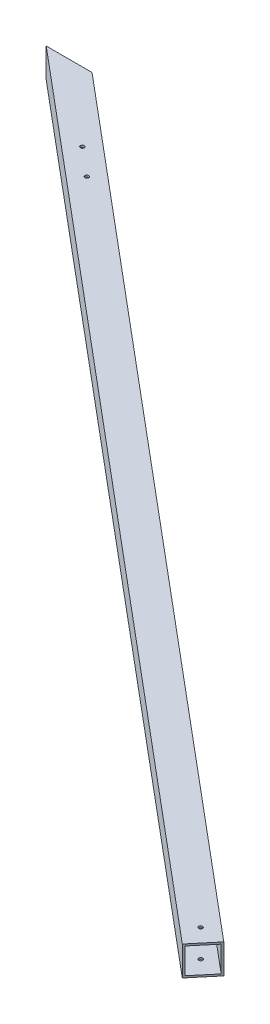
ISO-10303-21;
HEADER;
FILE_DESCRIPTION(('STEP AP214'),'2;1');
FILE_NAME('part.step','',(''),(''),'','','');
FILE_SCHEMA(('AUTOMOTIVE_DESIGN { 1 0 10303 214 1 1 1 1 }'));
ENDSEC;
DATA;
#1=APPLICATION_CONTEXT('core data for automotive mechanical design processes');
#2=APPLICATION_PROTOCOL_DEFINITION('international standard','automotive_design',2000,#1);
#3=PRODUCT_CONTEXT('',#1,'mechanical');
#4=PRODUCT('Part','Part','',(#3));
#5=PRODUCT_RELATED_PRODUCT_CATEGORY('part','',(#4));
#6=PRODUCT_DEFINITION_FORMATION('','',#4);
#7=PRODUCT_DEFINITION_CONTEXT('part definition',#1,'design');
#8=PRODUCT_DEFINITION('design','',#6,#7);
#9=PRODUCT_DEFINITION_SHAPE('','',#8);
#10=(LENGTH_UNIT() NAMED_UNIT(*) SI_UNIT(.MILLI.,.METRE.));
#11=(NAMED_UNIT(*) PLANE_ANGLE_UNIT() SI_UNIT($,.RADIAN.));
#12=(NAMED_UNIT(*) SI_UNIT($,.STERADIAN.) SOLID_ANGLE_UNIT());
#13=UNCERTAINTY_MEASURE_WITH_UNIT(LENGTH_MEASURE(1.E-05),#10,'distance_accuracy_value','');
#14=(GEOMETRIC_REPRESENTATION_CONTEXT(3) GLOBAL_UNCERTAINTY_ASSIGNED_CONTEXT((#13)) GLOBAL_UNIT_ASSIGNED_CONTEXT((#10,
#11,#12)) REPRESENTATION_CONTEXT('',''));
#15=CARTESIAN_POINT('',(0.,0.,0.));
#16=DIRECTION('',(0.,0.,1.));
#17=DIRECTION('',(1.,0.,0.));
#18=AXIS2_PLACEMENT_3D('',#15,#16,#17);
#19=CARTESIAN_POINT('',(1429.46336495137,-165.1,1236.70639682926));
#20=DIRECTION('',(0.766044443118978,0.,0.64278760968654));
#21=DIRECTION('',(0.64278760968654,0.,-0.766044443118978));
#22=AXIS2_PLACEMENT_3D('',#19,#20,#21);
#23=PLANE('',#22);
#24=DIRECTION('',(-0.64278760968654,0.,0.766044443118978));
#25=VECTOR('',#24,1.);
#26=CARTESIAN_POINT('',(1429.46336495137,-215.9,1236.70639682926));
#27=LINE('',#26,#25);
#28=CARTESIAN_POINT('',(1451.03750430922,-215.9,1210.99533874241));
#29=VERTEX_POINT('',#28);
#30=CARTESIAN_POINT('',(1418.38389373714,-215.9,1249.91039645286));
#31=VERTEX_POINT('',#30);
#32=EDGE_CURVE('E154',#29,#31,#27,.T.);
#33=ORIENTED_EDGE('',*,*,#32,.F.);
#34=DIRECTION('',(0.,-1.,0.));
#35=VECTOR('',#34,1.);
#36=CARTESIAN_POINT('',(1451.03750430922,-165.1,1210.99533874241));
#37=LINE('',#36,#35);
#38=CARTESIAN_POINT('',(1451.03750430922,-165.1,1210.99533874241));
#39=VERTEX_POINT('',#38);
#40=EDGE_CURVE('E183',#39,#29,#37,.T.);
#41=ORIENTED_EDGE('',*,*,#40,.F.);
#42=DIRECTION('',(-0.64278760968654,0.,0.766044443118978));
#43=VECTOR('',#42,1.);
#44=CARTESIAN_POINT('',(1429.46336495137,-165.1,1236.70639682926));
#45=LINE('',#44,#43);
#46=CARTESIAN_POINT('',(1418.38389373714,-165.1,1249.91039645286));
#47=VERTEX_POINT('',#46);
#48=EDGE_CURVE('E162',#39,#47,#45,.T.);
#49=ORIENTED_EDGE('',*,*,#48,.T.);
#50=DIRECTION('',(0.,-1.,0.));
#51=VECTOR('',#50,1.);
#52=CARTESIAN_POINT('',(1418.38389373714,-165.1,1249.91039645286));
#53=LINE('',#52,#51);
#54=EDGE_CURVE('E166',#47,#31,#53,.T.);
#55=ORIENTED_EDGE('',*,*,#54,.T.);
#56=EDGE_LOOP('',(#33,#41,#49,#55));
#57=FACE_BOUND('',#56,.T.);
#58=DIRECTION('',(0.,-1.,0.));
#59=VECTOR('',#58,1.);
#60=CARTESIAN_POINT('',(1448.99665364846,-165.1,1213.42752984932));
#61=LINE('',#60,#59);
#62=CARTESIAN_POINT('',(1448.99665364847,-168.275,1213.42752984932));
#63=VERTEX_POINT('',#62);
#64=CARTESIAN_POINT('',(1448.99665364847,-212.725,1213.42752984932));
#65=VERTEX_POINT('',#64);
#66=EDGE_CURVE('E109',#63,#65,#61,.T.);
#67=ORIENTED_EDGE('',*,*,#66,.T.);
#68=DIRECTION('',(-0.64278760968654,0.,0.766044443118978));
#69=VECTOR('',#68,1.);
#70=CARTESIAN_POINT('',(1437.6367948509,-212.725,1226.96568238268));
#71=LINE('',#70,#69);
#72=CARTESIAN_POINT('',(1420.4247443979,-212.725,1247.47820534596));
#73=VERTEX_POINT('',#72);
#74=EDGE_CURVE('E115',#65,#73,#71,.T.);
#75=ORIENTED_EDGE('',*,*,#74,.T.);
#76=DIRECTION('',(0.,-1.,0.));
#77=VECTOR('',#76,1.);
#78=CARTESIAN_POINT('',(1420.4247443979,-165.1,1247.47820534596));
#79=LINE('',#78,#77);
#80=CARTESIAN_POINT('',(1420.4247443979,-168.275,1247.47820534596));
#81=VERTEX_POINT('',#80);
#82=EDGE_CURVE('E100',#81,#73,#79,.T.);
#83=ORIENTED_EDGE('',*,*,#82,.F.);
#84=DIRECTION('',(-0.64278760968654,0.,0.766044443118978));
#85=VECTOR('',#84,1.);
#86=CARTESIAN_POINT('',(1437.6367948509,-168.275,1226.96568238268));
#87=LINE('',#86,#85);
#88=EDGE_CURVE('E110',#63,#81,#87,.T.);
#89=ORIENTED_EDGE('',*,*,#88,.F.);
#90=EDGE_LOOP('',(#67,#75,#83,#89));
#91=FACE_BOUND('',#90,.T.);
#92=ADVANCED_FACE('F14',(#57,#91),#23,.T.);
#93=CARTESIAN_POINT('',(-25.5109240608956,-165.1,25.4));
#94=DIRECTION('',(0.,0.,-1.));
#95=DIRECTION('',(-1.,0.,0.));
#96=AXIS2_PLACEMENT_3D('',#93,#94,#95);
#97=PLANE('',#96);
#98=DIRECTION('',(1.,0.,0.));
#99=VECTOR('',#98,1.);
#100=CARTESIAN_POINT('',(-25.5109240608956,-215.9,25.4));
#101=LINE('',#100,#99);
#102=CARTESIAN_POINT('',(-40.930770404508,-215.9,25.4));
#103=VERTEX_POINT('',#102);
#104=CARTESIAN_POINT('',(38.1,-215.9,25.4));
#105=VERTEX_POINT('',#104);
#106=EDGE_CURVE('E170',#103,#105,#101,.T.);
#107=ORIENTED_EDGE('',*,*,#106,.F.);
#108=DIRECTION('',(0.,-1.,0.));
#109=VECTOR('',#108,1.);
#110=CARTESIAN_POINT('',(-40.930770404508,-165.1,25.4));
#111=LINE('',#110,#109);
#112=CARTESIAN_POINT('',(-40.930770404508,-165.1,25.4));
#113=VERTEX_POINT('',#112);
#114=EDGE_CURVE('E9',#113,#103,#111,.T.);
#115=ORIENTED_EDGE('',*,*,#114,.F.);
#116=DIRECTION('',(1.,0.,0.));
#117=VECTOR('',#116,1.);
#118=CARTESIAN_POINT('',(-25.5109240608956,-165.1,25.4));
#119=LINE('',#118,#117);
#120=CARTESIAN_POINT('',(38.1,-165.1,25.4));
#121=VERTEX_POINT('',#120);
#122=EDGE_CURVE('E153',#113,#121,#119,.T.);
#123=ORIENTED_EDGE('',*,*,#122,.T.);
#124=DIRECTION('',(0.,-1.,0.));
#125=VECTOR('',#124,1.);
#126=CARTESIAN_POINT('',(38.1,-165.1,25.4));
#127=LINE('',#126,#125);
#128=EDGE_CURVE('E24',#121,#105,#127,.T.);
#129=ORIENTED_EDGE('',*,*,#128,.T.);
#130=EDGE_LOOP('',(#107,#115,#123,#129));
#131=FACE_BOUND('',#130,.T.);
#132=DIRECTION('',(0.,-1.,0.));
#133=VECTOR('',#132,1.);
#134=CARTESIAN_POINT('',(-35.9913472542262,-165.1,25.4));
#135=LINE('',#134,#133);
#136=CARTESIAN_POINT('',(-35.9913472542262,-168.275,25.4));
#137=VERTEX_POINT('',#136);
#138=CARTESIAN_POINT('',(-35.9913472542262,-212.725,25.4));
#139=VERTEX_POINT('',#138);
#140=EDGE_CURVE('E139',#137,#139,#135,.T.);
#141=ORIENTED_EDGE('',*,*,#140,.T.);
#142=DIRECTION('',(1.,0.,0.));
#143=VECTOR('',#142,1.);
#144=CARTESIAN_POINT('',(705.053366952357,-212.725,25.4));
#145=LINE('',#144,#143);
#146=CARTESIAN_POINT('',(33.1605768497183,-212.725,25.4));
#147=VERTEX_POINT('',#146);
#148=EDGE_CURVE('E118',#139,#147,#145,.T.);
#149=ORIENTED_EDGE('',*,*,#148,.T.);
#150=DIRECTION('',(0.,-1.,0.));
#151=VECTOR('',#150,1.);
#152=CARTESIAN_POINT('',(33.1605768497183,-165.1,25.4));
#153=LINE('',#152,#151);
#154=CARTESIAN_POINT('',(33.1605768497183,-168.275,25.4));
#155=VERTEX_POINT('',#154);
#156=EDGE_CURVE('E137',#155,#147,#153,.T.);
#157=ORIENTED_EDGE('',*,*,#156,.F.);
#158=DIRECTION('',(1.,0.,0.));
#159=VECTOR('',#158,1.);
#160=CARTESIAN_POINT('',(705.053366952357,-168.275,25.4));
#161=LINE('',#160,#159);
#162=EDGE_CURVE('E130',#137,#155,#161,.T.);
#163=ORIENTED_EDGE('',*,*,#162,.F.);
#164=EDGE_LOOP('',(#141,#149,#157,#163));
#165=FACE_BOUND('',#164,.T.);
#166=ADVANCED_FACE('F237',(#131,#165),#97,.T.);
#167=CARTESIAN_POINT('',(278.112903575089,-165.1,293.109429165724));
#168=DIRECTION('',(-0.64278760968654,0.,0.766044443118978));
#169=DIRECTION('',(0.766044443118978,0.,0.64278760968654));
#170=AXIS2_PLACEMENT_3D('',#167,#168,#169);
#171=PLANE('',#170);
#172=DIRECTION('',(-0.766044443118978,0.,-0.64278760968654));
#173=VECTOR('',#172,1.);
#174=CARTESIAN_POINT('',(278.112903575089,-215.9,293.109429165724));
#175=LINE('',#174,#173);
#176=EDGE_CURVE('E142',#31,#103,#175,.T.);
#177=ORIENTED_EDGE('',*,*,#176,.F.);
#178=ORIENTED_EDGE('',*,*,#54,.F.);
#179=DIRECTION('',(-0.766044443118978,0.,-0.64278760968654));
#180=VECTOR('',#179,1.);
#181=CARTESIAN_POINT('',(278.112903575089,-165.1,293.109429165724));
#182=LINE('',#181,#180);
#183=EDGE_CURVE('E149',#47,#113,#182,.T.);
#184=ORIENTED_EDGE('',*,*,#183,.T.);
#185=ORIENTED_EDGE('',*,*,#114,.T.);
#186=EDGE_LOOP('',(#177,#178,#184,#185));
#187=FACE_BOUND('',#186,.T.);
#188=ADVANCED_FACE('F16',(#187),#171,.T.);
#189=CARTESIAN_POINT('',(360.587988116179,-165.1,295.999551887389));
#190=DIRECTION('',(0.64278760968654,0.,-0.766044443118978));
#191=DIRECTION('',(-0.766044443118978,0.,-0.64278760968654));
#192=AXIS2_PLACEMENT_3D('',#189,#190,#191);
#193=PLANE('',#192);
#194=DIRECTION('',(0.766044443118978,0.,0.64278760968654));
#195=VECTOR('',#194,1.);
#196=CARTESIAN_POINT('',(360.587988116179,-215.9,295.999551887389));
#197=LINE('',#196,#195);
#198=EDGE_CURVE('E174',#105,#29,#197,.T.);
#199=ORIENTED_EDGE('',*,*,#198,.F.);
#200=ORIENTED_EDGE('',*,*,#128,.F.);
#201=DIRECTION('',(0.766044443118978,0.,0.64278760968654));
#202=VECTOR('',#201,1.);
#203=CARTESIAN_POINT('',(360.587988116179,-165.1,295.999551887389));
#204=LINE('',#203,#202);
#205=EDGE_CURVE('E158',#121,#39,#204,.T.);
#206=ORIENTED_EDGE('',*,*,#205,.T.);
#207=ORIENTED_EDGE('',*,*,#40,.T.);
#208=EDGE_LOOP('',(#199,#200,#206,#207));
#209=FACE_BOUND('',#208,.T.);
#210=ADVANCED_FACE('F261',(#209),#193,.T.);
#211=CARTESIAN_POINT('',(705.053366952356,-165.1,612.255198226429));
#212=DIRECTION('',(0.,-1.,0.));
#213=DIRECTION('',(1.,0.,0.));
#214=AXIS2_PLACEMENT_3D('',#211,#212,#213);
#215=PLANE('',#214);
#216=CARTESIAN_POINT('',(140.785030150917,-165.1,144.720316076102));
#217=DIRECTION('',(0.,-1.,0.));
#218=DIRECTION('',(0.,0.,-1.));
#219=AXIS2_PLACEMENT_3D('',#216,#217,#218);
#220=CIRCLE('',#219,3.3782);
#221=CARTESIAN_POINT('',(140.785030150917,-165.1,141.342116076102));
#222=VERTEX_POINT('',#221);
#223=EDGE_CURVE('E208',#222,#222,#220,.F.);
#224=ORIENTED_EDGE('',*,*,#223,.F.);
#225=EDGE_LOOP('',(#224));
#226=FACE_BOUND('',#225,.T.);
#227=CARTESIAN_POINT('',(189.428852288973,-165.1,185.537329291197));
#228=DIRECTION('',(0.,-1.,0.));
#229=DIRECTION('',(0.,0.,-1.));
#230=AXIS2_PLACEMENT_3D('',#227,#228,#229);
#231=CIRCLE('',#230,3.3782);
#232=CARTESIAN_POINT('',(189.428852288973,-165.1,182.159129291197));
#233=VERTEX_POINT('',#232);
#234=EDGE_CURVE('E204',#233,#233,#231,.F.);
#235=ORIENTED_EDGE('',*,*,#234,.F.);
#236=EDGE_LOOP('',(#235));
#237=FACE_BOUND('',#236,.T.);
#238=CARTESIAN_POINT('',(1409.31069902318,-165.1,1209.13973696573));
#239=DIRECTION('',(0.,1.,0.));
#240=DIRECTION('',(0.,0.,1.));
#241=AXIS2_PLACEMENT_3D('',#238,#239,#240);
#242=CIRCLE('',#241,3.36549999999991);
#243=CARTESIAN_POINT('',(1409.31069902318,-165.1,1212.50523696573));
#244=VERTEX_POINT('',#243);
#245=EDGE_CURVE('E192',#244,#244,#242,.T.);
#246=ORIENTED_EDGE('',*,*,#245,.F.);
#247=EDGE_LOOP('',(#246));
#248=FACE_BOUND('',#247,.T.);
#249=ORIENTED_EDGE('',*,*,#183,.F.);
#250=ORIENTED_EDGE('',*,*,#48,.F.);
#251=ORIENTED_EDGE('',*,*,#205,.F.);
#252=ORIENTED_EDGE('',*,*,#122,.F.);
#253=EDGE_LOOP('',(#249,#250,#251,#252));
#254=FACE_BOUND('',#253,.T.);
#255=ADVANCED_FACE('F263',(#226,#237,#248,#254),#215,.F.);
#256=CARTESIAN_POINT('',(705.053366952356,-215.9,612.255198226429));
#257=DIRECTION('',(0.,-1.,0.));
#258=DIRECTION('',(1.,0.,0.));
#259=AXIS2_PLACEMENT_3D('',#256,#257,#258);
#260=PLANE('',#259);
#261=CARTESIAN_POINT('',(140.785030150917,-215.9,144.720316076102));
#262=DIRECTION('',(0.,-1.,0.));
#263=DIRECTION('',(0.,0.,-1.));
#264=AXIS2_PLACEMENT_3D('',#261,#262,#263);
#265=CIRCLE('',#264,3.3782);
#266=CARTESIAN_POINT('',(140.785030150917,-215.9,141.342116076102));
#267=VERTEX_POINT('',#266);
#268=EDGE_CURVE('E287',#267,#267,#265,.T.);
#269=ORIENTED_EDGE('',*,*,#268,.F.);
#270=EDGE_LOOP('',(#269));
#271=FACE_BOUND('',#270,.T.);
#272=CARTESIAN_POINT('',(189.428852288973,-215.9,185.537329291197));
#273=DIRECTION('',(0.,-1.,0.));
#274=DIRECTION('',(0.,0.,-1.));
#275=AXIS2_PLACEMENT_3D('',#272,#273,#274);
#276=CIRCLE('',#275,3.3782);
#277=CARTESIAN_POINT('',(189.428852288973,-215.9,182.159129291197));
#278=VERTEX_POINT('',#277);
#279=EDGE_CURVE('E197',#278,#278,#276,.T.);
#280=ORIENTED_EDGE('',*,*,#279,.F.);
#281=EDGE_LOOP('',(#280));
#282=FACE_BOUND('',#281,.T.);
#283=CARTESIAN_POINT('',(1409.31069902318,-215.9,1209.13973696573));
#284=DIRECTION('',(0.,-1.,0.));
#285=DIRECTION('',(0.,0.,-1.));
#286=AXIS2_PLACEMENT_3D('',#283,#284,#285);
#287=CIRCLE('',#286,3.36549999999991);
#288=CARTESIAN_POINT('',(1409.31069902318,-215.9,1205.77423696573));
#289=VERTEX_POINT('',#288);
#290=EDGE_CURVE('E120',#289,#289,#287,.F.);
#291=ORIENTED_EDGE('',*,*,#290,.T.);
#292=EDGE_LOOP('',(#291));
#293=FACE_BOUND('',#292,.T.);
#294=ORIENTED_EDGE('',*,*,#176,.T.);
#295=ORIENTED_EDGE('',*,*,#106,.T.);
#296=ORIENTED_EDGE('',*,*,#198,.T.);
#297=ORIENTED_EDGE('',*,*,#32,.T.);
#298=EDGE_LOOP('',(#294,#295,#296,#297));
#299=FACE_BOUND('',#298,.T.);
#300=ADVANCED_FACE('F248',(#271,#282,#293,#299),#260,.T.);
#301=CARTESIAN_POINT('',(280.153754235844,-165.1,290.677238058822));
#302=DIRECTION('',(-0.64278760968654,0.,0.766044443118978));
#303=DIRECTION('',(0.766044443118978,0.,0.64278760968654));
#304=AXIS2_PLACEMENT_3D('',#301,#302,#303);
#305=PLANE('',#304);
#306=DIRECTION('',(-0.766044443118978,0.,-0.64278760968654));
#307=VECTOR('',#306,1.);
#308=CARTESIAN_POINT('',(687.841316499359,-212.725,632.767721189702));
#309=LINE('',#308,#307);
#310=EDGE_CURVE('E103',#73,#139,#309,.T.);
#311=ORIENTED_EDGE('',*,*,#310,.T.);
#312=ORIENTED_EDGE('',*,*,#140,.F.);
#313=DIRECTION('',(-0.766044443118978,0.,-0.64278760968654));
#314=VECTOR('',#313,1.);
#315=CARTESIAN_POINT('',(687.841316499359,-168.275,632.767721189702));
#316=LINE('',#315,#314);
#317=EDGE_CURVE('E37',#81,#137,#316,.T.);
#318=ORIENTED_EDGE('',*,*,#317,.F.);
#319=ORIENTED_EDGE('',*,*,#82,.T.);
#320=EDGE_LOOP('',(#311,#312,#318,#319));
#321=FACE_BOUND('',#320,.T.);
#322=ADVANCED_FACE('F102',(#321),#305,.F.);
#323=CARTESIAN_POINT('',(358.547137455424,-165.1,298.431742994291));
#324=DIRECTION('',(0.64278760968654,0.,-0.766044443118978));
#325=DIRECTION('',(-0.766044443118978,0.,-0.64278760968654));
#326=AXIS2_PLACEMENT_3D('',#323,#324,#325);
#327=PLANE('',#326);
#328=DIRECTION('',(0.766044443118978,0.,0.64278760968654));
#329=VECTOR('',#328,1.);
#330=CARTESIAN_POINT('',(716.413225749925,-212.725,598.717045693064));
#331=LINE('',#330,#329);
#332=EDGE_CURVE('E124',#147,#65,#331,.T.);
#333=ORIENTED_EDGE('',*,*,#332,.T.);
#334=ORIENTED_EDGE('',*,*,#66,.F.);
#335=DIRECTION('',(0.766044443118978,0.,0.64278760968654));
#336=VECTOR('',#335,1.);
#337=CARTESIAN_POINT('',(716.413225749925,-168.275,598.717045693064));
#338=LINE('',#337,#336);
#339=EDGE_CURVE('E49',#155,#63,#338,.T.);
#340=ORIENTED_EDGE('',*,*,#339,.F.);
#341=ORIENTED_EDGE('',*,*,#156,.T.);
#342=EDGE_LOOP('',(#333,#334,#340,#341));
#343=FACE_BOUND('',#342,.T.);
#344=ADVANCED_FACE('F238',(#343),#327,.F.);
#345=CARTESIAN_POINT('',(705.053366952356,-168.275,612.255198226429));
#346=DIRECTION('',(0.,-1.,0.));
#347=DIRECTION('',(1.,0.,0.));
#348=AXIS2_PLACEMENT_3D('',#345,#346,#347);
#349=PLANE('',#348);
#350=CARTESIAN_POINT('',(140.785030150917,-168.275,144.720316076102));
#351=DIRECTION('',(0.,-1.,0.));
#352=DIRECTION('',(0.,0.,-1.));
#353=AXIS2_PLACEMENT_3D('',#350,#351,#352);
#354=CIRCLE('',#353,3.3782);
#355=CARTESIAN_POINT('',(140.785030150917,-168.275,141.342116076102));
#356=VERTEX_POINT('',#355);
#357=EDGE_CURVE('E216',#356,#356,#354,.F.);
#358=ORIENTED_EDGE('',*,*,#357,.T.);
#359=EDGE_LOOP('',(#358));
#360=FACE_BOUND('',#359,.T.);
#361=CARTESIAN_POINT('',(189.428852288973,-168.275,185.537329291197));
#362=DIRECTION('',(0.,-1.,0.));
#363=DIRECTION('',(0.,0.,-1.));
#364=AXIS2_PLACEMENT_3D('',#361,#362,#363);
#365=CIRCLE('',#364,3.3782);
#366=CARTESIAN_POINT('',(189.428852288973,-168.275,182.159129291197));
#367=VERTEX_POINT('',#366);
#368=EDGE_CURVE('E196',#367,#367,#365,.F.);
#369=ORIENTED_EDGE('',*,*,#368,.T.);
#370=EDGE_LOOP('',(#369));
#371=FACE_BOUND('',#370,.T.);
#372=CARTESIAN_POINT('',(1409.31069902318,-168.275,1209.13973696573));
#373=DIRECTION('',(0.,-1.,0.));
#374=DIRECTION('',(0.,0.,-1.));
#375=AXIS2_PLACEMENT_3D('',#372,#373,#374);
#376=CIRCLE('',#375,3.36549999999991);
#377=CARTESIAN_POINT('',(1409.31069902318,-168.275,1205.77423696573));
#378=VERTEX_POINT('',#377);
#379=EDGE_CURVE('E191',#378,#378,#376,.F.);
#380=ORIENTED_EDGE('',*,*,#379,.T.);
#381=EDGE_LOOP('',(#380));
#382=FACE_BOUND('',#381,.T.);
#383=ORIENTED_EDGE('',*,*,#317,.T.);
#384=ORIENTED_EDGE('',*,*,#162,.T.);
#385=ORIENTED_EDGE('',*,*,#339,.T.);
#386=ORIENTED_EDGE('',*,*,#88,.T.);
#387=EDGE_LOOP('',(#383,#384,#385,#386));
#388=FACE_BOUND('',#387,.T.);
#389=ADVANCED_FACE('F233',(#360,#371,#382,#388),#349,.T.);
#390=CARTESIAN_POINT('',(705.053366952356,-212.725,612.255198226429));
#391=DIRECTION('',(0.,-1.,0.));
#392=DIRECTION('',(1.,0.,0.));
#393=AXIS2_PLACEMENT_3D('',#390,#391,#392);
#394=PLANE('',#393);
#395=CARTESIAN_POINT('',(140.785030150917,-212.725,144.720316076102));
#396=DIRECTION('',(0.,-1.,0.));
#397=DIRECTION('',(0.,0.,-1.));
#398=AXIS2_PLACEMENT_3D('',#395,#396,#397);
#399=CIRCLE('',#398,3.3782);
#400=CARTESIAN_POINT('',(140.785030150917,-212.725,141.342116076102));
#401=VERTEX_POINT('',#400);
#402=EDGE_CURVE('E18',#401,#401,#399,.F.);
#403=ORIENTED_EDGE('',*,*,#402,.F.);
#404=EDGE_LOOP('',(#403));
#405=FACE_BOUND('',#404,.T.);
#406=CARTESIAN_POINT('',(189.428852288973,-212.725,185.537329291197));
#407=DIRECTION('',(0.,-1.,0.));
#408=DIRECTION('',(0.,0.,-1.));
#409=AXIS2_PLACEMENT_3D('',#406,#407,#408);
#410=CIRCLE('',#409,3.3782);
#411=CARTESIAN_POINT('',(189.428852288973,-212.725,182.159129291197));
#412=VERTEX_POINT('',#411);
#413=EDGE_CURVE('E193',#412,#412,#410,.F.);
#414=ORIENTED_EDGE('',*,*,#413,.F.);
#415=EDGE_LOOP('',(#414));
#416=FACE_BOUND('',#415,.T.);
#417=CARTESIAN_POINT('',(1409.31069902318,-212.725,1209.13973696573));
#418=DIRECTION('',(0.,-1.,0.));
#419=DIRECTION('',(0.,0.,-1.));
#420=AXIS2_PLACEMENT_3D('',#417,#418,#419);
#421=CIRCLE('',#420,3.36549999999991);
#422=CARTESIAN_POINT('',(1409.31069902318,-212.725,1205.77423696573));
#423=VERTEX_POINT('',#422);
#424=EDGE_CURVE('E188',#423,#423,#421,.F.);
#425=ORIENTED_EDGE('',*,*,#424,.F.);
#426=EDGE_LOOP('',(#425));
#427=FACE_BOUND('',#426,.T.);
#428=ORIENTED_EDGE('',*,*,#310,.F.);
#429=ORIENTED_EDGE('',*,*,#74,.F.);
#430=ORIENTED_EDGE('',*,*,#332,.F.);
#431=ORIENTED_EDGE('',*,*,#148,.F.);
#432=EDGE_LOOP('',(#428,#429,#430,#431));
#433=FACE_BOUND('',#432,.T.);
#434=ADVANCED_FACE('F113',(#405,#416,#427,#433),#394,.F.);
#435=CARTESIAN_POINT('',(1409.31069902318,-2096.9077430591,1209.13973696573));
#436=DIRECTION('',(0.,1.,0.));
#437=DIRECTION('',(0.,0.,1.));
#438=AXIS2_PLACEMENT_3D('',#435,#436,#437);
#439=CYLINDRICAL_SURFACE('',#438,3.36549999999991);
#440=ORIENTED_EDGE('',*,*,#290,.F.);
#441=EDGE_LOOP('',(#440));
#442=FACE_BOUND('',#441,.T.);
#443=ORIENTED_EDGE('',*,*,#424,.T.);
#444=EDGE_LOOP('',(#443));
#445=FACE_BOUND('',#444,.T.);
#446=ADVANCED_FACE('F291',(#442,#445),#439,.F.);
#447=ORIENTED_EDGE('',*,*,#379,.F.);
#448=EDGE_LOOP('',(#447));
#449=FACE_BOUND('',#448,.T.);
#450=ORIENTED_EDGE('',*,*,#245,.T.);
#451=EDGE_LOOP('',(#450));
#452=FACE_BOUND('',#451,.T.);
#453=ADVANCED_FACE('F294',(#449,#452),#439,.F.);
#454=CARTESIAN_POINT('',(189.428852288973,1715.91155852403,185.537329291197));
#455=DIRECTION('',(0.,-1.,0.));
#456=DIRECTION('',(0.,0.,-1.));
#457=AXIS2_PLACEMENT_3D('',#454,#455,#456);
#458=CYLINDRICAL_SURFACE('',#457,3.3782);
#459=ORIENTED_EDGE('',*,*,#279,.T.);
#460=EDGE_LOOP('',(#459));
#461=FACE_BOUND('',#460,.T.);
#462=ORIENTED_EDGE('',*,*,#413,.T.);
#463=EDGE_LOOP('',(#462));
#464=FACE_BOUND('',#463,.T.);
#465=ADVANCED_FACE('F327',(#461,#464),#458,.F.);
#466=ORIENTED_EDGE('',*,*,#368,.F.);
#467=EDGE_LOOP('',(#466));
#468=FACE_BOUND('',#467,.T.);
#469=ORIENTED_EDGE('',*,*,#234,.T.);
#470=EDGE_LOOP('',(#469));
#471=FACE_BOUND('',#470,.T.);
#472=ADVANCED_FACE('F320',(#468,#471),#458,.F.);
#473=CARTESIAN_POINT('',(140.785030150917,1715.91155852403,144.720316076102));
#474=DIRECTION('',(0.,-1.,0.));
#475=DIRECTION('',(0.,0.,-1.));
#476=AXIS2_PLACEMENT_3D('',#473,#474,#475);
#477=CYLINDRICAL_SURFACE('',#476,3.3782);
#478=ORIENTED_EDGE('',*,*,#268,.T.);
#479=EDGE_LOOP('',(#478));
#480=FACE_BOUND('',#479,.T.);
#481=ORIENTED_EDGE('',*,*,#402,.T.);
#482=EDGE_LOOP('',(#481));
#483=FACE_BOUND('',#482,.T.);
#484=ADVANCED_FACE('F317',(#480,#483),#477,.F.);
#485=ORIENTED_EDGE('',*,*,#357,.F.);
#486=EDGE_LOOP('',(#485));
#487=FACE_BOUND('',#486,.T.);
#488=ORIENTED_EDGE('',*,*,#223,.T.);
#489=EDGE_LOOP('',(#488));
#490=FACE_BOUND('',#489,.T.);
#491=ADVANCED_FACE('F319',(#487,#490),#477,.F.);
#492=CLOSED_SHELL('',(#92,#166,#188,#210,#255,#300,#322,#344,#389,#434,#446,#453,#465,#472,#484,#491));
#493=MANIFOLD_SOLID_BREP('B1',#492);
#494=ADVANCED_BREP_SHAPE_REPRESENTATION('',(#18,#493),#14);
#495=SHAPE_DEFINITION_REPRESENTATION(#9,#494);
ENDSEC;
END-ISO-10303-21;
